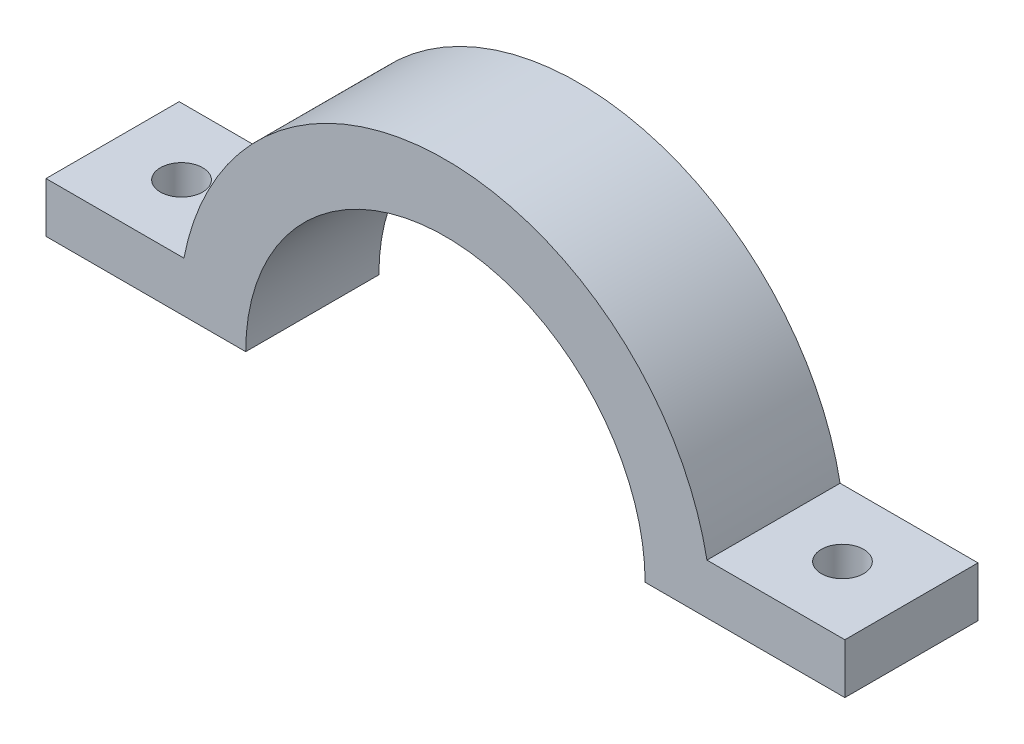
ISO-10303-21;
HEADER;
FILE_DESCRIPTION(('STEP AP214'),'2;1');
FILE_NAME('part.step','',(''),(''),'','','');
FILE_SCHEMA(('AUTOMOTIVE_DESIGN { 1 0 10303 214 1 1 1 1 }'));
ENDSEC;
DATA;
#1=APPLICATION_CONTEXT('core data for automotive mechanical design processes');
#2=APPLICATION_PROTOCOL_DEFINITION('international standard','automotive_design',2000,#1);
#3=PRODUCT_CONTEXT('',#1,'mechanical');
#4=PRODUCT('Part','Part','',(#3));
#5=PRODUCT_RELATED_PRODUCT_CATEGORY('part','',(#4));
#6=PRODUCT_DEFINITION_FORMATION('','',#4);
#7=PRODUCT_DEFINITION_CONTEXT('part definition',#1,'design');
#8=PRODUCT_DEFINITION('design','',#6,#7);
#9=PRODUCT_DEFINITION_SHAPE('','',#8);
#10=(LENGTH_UNIT() NAMED_UNIT(*) SI_UNIT(.MILLI.,.METRE.));
#11=(NAMED_UNIT(*) PLANE_ANGLE_UNIT() SI_UNIT($,.RADIAN.));
#12=(NAMED_UNIT(*) SI_UNIT($,.STERADIAN.) SOLID_ANGLE_UNIT());
#13=UNCERTAINTY_MEASURE_WITH_UNIT(LENGTH_MEASURE(1.E-05),#10,'distance_accuracy_value','');
#14=(GEOMETRIC_REPRESENTATION_CONTEXT(3) GLOBAL_UNCERTAINTY_ASSIGNED_CONTEXT((#13)) GLOBAL_UNIT_ASSIGNED_CONTEXT((#10,
#11,#12)) REPRESENTATION_CONTEXT('',''));
#15=CARTESIAN_POINT('',(0.,0.,0.));
#16=DIRECTION('',(0.,0.,1.));
#17=DIRECTION('',(1.,0.,0.));
#18=AXIS2_PLACEMENT_3D('',#15,#16,#17);
#19=CARTESIAN_POINT('',(0.,0.,10.));
#20=DIRECTION('',(0.,0.,-1.));
#21=DIRECTION('',(-1.,0.,0.));
#22=AXIS2_PLACEMENT_3D('',#19,#20,#21);
#23=CYLINDRICAL_SURFACE('',#22,15.);
#24=CARTESIAN_POINT('',(0.,0.,0.));
#25=DIRECTION('',(0.,0.,-1.));
#26=DIRECTION('',(-1.,0.,0.));
#27=AXIS2_PLACEMENT_3D('',#24,#25,#26);
#28=CIRCLE('',#27,15.);
#29=CARTESIAN_POINT('',(-15.,0.,0.));
#30=VERTEX_POINT('',#29);
#31=CARTESIAN_POINT('',(15.,0.,0.));
#32=VERTEX_POINT('',#31);
#33=EDGE_CURVE('E131',#30,#32,#28,.T.);
#34=ORIENTED_EDGE('',*,*,#33,.T.);
#35=DIRECTION('',(0.,0.,-1.));
#36=VECTOR('',#35,1.);
#37=CARTESIAN_POINT('',(15.,0.,10.));
#38=LINE('',#37,#36);
#39=CARTESIAN_POINT('',(15.,0.,10.));
#40=VERTEX_POINT('',#39);
#41=EDGE_CURVE('E11',#40,#32,#38,.T.);
#42=ORIENTED_EDGE('',*,*,#41,.F.);
#43=CARTESIAN_POINT('',(0.,0.,10.));
#44=DIRECTION('',(0.,0.,-1.));
#45=DIRECTION('',(-1.,0.,0.));
#46=AXIS2_PLACEMENT_3D('',#43,#44,#45);
#47=CIRCLE('',#46,15.);
#48=CARTESIAN_POINT('',(-15.,0.,10.));
#49=VERTEX_POINT('',#48);
#50=EDGE_CURVE('E147',#49,#40,#47,.T.);
#51=ORIENTED_EDGE('',*,*,#50,.F.);
#52=DIRECTION('',(0.,0.,-1.));
#53=VECTOR('',#52,1.);
#54=CARTESIAN_POINT('',(-15.,0.,10.));
#55=LINE('',#54,#53);
#56=EDGE_CURVE('E127',#49,#30,#55,.T.);
#57=ORIENTED_EDGE('',*,*,#56,.T.);
#58=EDGE_LOOP('',(#34,#42,#51,#57));
#59=FACE_BOUND('',#58,.T.);
#60=ADVANCED_FACE('F34',(#59),#23,.F.);
#61=CARTESIAN_POINT('',(20.,0.,10.));
#62=DIRECTION('',(0.,1.,0.));
#63=DIRECTION('',(0.,0.,1.));
#64=AXIS2_PLACEMENT_3D('',#61,#62,#63);
#65=PLANE('',#64);
#66=CARTESIAN_POINT('',(24.8211447123228,0.,5.));
#67=DIRECTION('',(0.,1.,0.));
#68=DIRECTION('',(0.,0.,1.));
#69=AXIS2_PLACEMENT_3D('',#66,#67,#68);
#70=CIRCLE('',#69,1.5875);
#71=CARTESIAN_POINT('',(24.8211447123228,0.,6.5875));
#72=VERTEX_POINT('',#71);
#73=EDGE_CURVE('E135',#72,#72,#70,.F.);
#74=ORIENTED_EDGE('',*,*,#73,.F.);
#75=EDGE_LOOP('',(#74));
#76=FACE_BOUND('',#75,.T.);
#77=DIRECTION('',(1.,0.,0.));
#78=VECTOR('',#77,1.);
#79=CARTESIAN_POINT('',(20.,0.,0.));
#80=LINE('',#79,#78);
#81=CARTESIAN_POINT('',(30.,0.,0.));
#82=VERTEX_POINT('',#81);
#83=EDGE_CURVE('E134',#32,#82,#80,.T.);
#84=ORIENTED_EDGE('',*,*,#83,.T.);
#85=DIRECTION('',(0.,0.,-1.));
#86=VECTOR('',#85,1.);
#87=CARTESIAN_POINT('',(30.,0.,10.));
#88=LINE('',#87,#86);
#89=CARTESIAN_POINT('',(30.,0.,10.));
#90=VERTEX_POINT('',#89);
#91=EDGE_CURVE('E42',#90,#82,#88,.T.);
#92=ORIENTED_EDGE('',*,*,#91,.F.);
#93=DIRECTION('',(1.,0.,0.));
#94=VECTOR('',#93,1.);
#95=CARTESIAN_POINT('',(15.,0.,10.));
#96=LINE('',#95,#94);
#97=EDGE_CURVE('E91',#40,#90,#96,.T.);
#98=ORIENTED_EDGE('',*,*,#97,.F.);
#99=ORIENTED_EDGE('',*,*,#41,.T.);
#100=EDGE_LOOP('',(#84,#92,#98,#99));
#101=FACE_BOUND('',#100,.T.);
#102=ADVANCED_FACE('F203',(#76,#101),#65,.F.);
#103=CARTESIAN_POINT('',(30.,0.,10.));
#104=DIRECTION('',(-1.,0.,0.));
#105=DIRECTION('',(0.,0.,1.));
#106=AXIS2_PLACEMENT_3D('',#103,#104,#105);
#107=PLANE('',#106);
#108=DIRECTION('',(0.,1.,0.));
#109=VECTOR('',#108,1.);
#110=CARTESIAN_POINT('',(30.,0.,0.));
#111=LINE('',#110,#109);
#112=CARTESIAN_POINT('',(30.,3.76569597265335,0.));
#113=VERTEX_POINT('',#112);
#114=EDGE_CURVE('E137',#82,#113,#111,.T.);
#115=ORIENTED_EDGE('',*,*,#114,.T.);
#116=DIRECTION('',(0.,0.,-1.));
#117=VECTOR('',#116,1.);
#118=CARTESIAN_POINT('',(30.,3.76569597265335,10.));
#119=LINE('',#118,#117);
#120=CARTESIAN_POINT('',(30.,3.76569597265335,10.));
#121=VERTEX_POINT('',#120);
#122=EDGE_CURVE('E154',#121,#113,#119,.T.);
#123=ORIENTED_EDGE('',*,*,#122,.F.);
#124=DIRECTION('',(0.,1.,0.));
#125=VECTOR('',#124,1.);
#126=CARTESIAN_POINT('',(30.,0.,10.));
#127=LINE('',#126,#125);
#128=EDGE_CURVE('E162',#90,#121,#127,.T.);
#129=ORIENTED_EDGE('',*,*,#128,.F.);
#130=ORIENTED_EDGE('',*,*,#91,.T.);
#131=EDGE_LOOP('',(#115,#123,#129,#130));
#132=FACE_BOUND('',#131,.T.);
#133=ADVANCED_FACE('F160',(#132),#107,.F.);
#134=CARTESIAN_POINT('',(30.,3.76569597265335,10.));
#135=DIRECTION('',(0.,-1.,0.));
#136=DIRECTION('',(1.,0.,0.));
#137=AXIS2_PLACEMENT_3D('',#134,#135,#136);
#138=PLANE('',#137);
#139=CARTESIAN_POINT('',(24.8211447123228,3.76569597265335,5.));
#140=DIRECTION('',(0.,1.,0.));
#141=DIRECTION('',(-1.,0.,0.));
#142=AXIS2_PLACEMENT_3D('',#139,#140,#141);
#143=CIRCLE('',#142,1.5875);
#144=CARTESIAN_POINT('',(23.2336447123228,3.76569597265335,5.));
#145=VERTEX_POINT('',#144);
#146=EDGE_CURVE('E180',#145,#145,#143,.T.);
#147=ORIENTED_EDGE('',*,*,#146,.F.);
#148=EDGE_LOOP('',(#147));
#149=FACE_BOUND('',#148,.T.);
#150=DIRECTION('',(-1.,0.,0.));
#151=VECTOR('',#150,1.);
#152=CARTESIAN_POINT('',(30.,3.76569597265335,0.));
#153=LINE('',#152,#151);
#154=CARTESIAN_POINT('',(19.6422894246455,3.76569597265336,0.));
#155=VERTEX_POINT('',#154);
#156=EDGE_CURVE('E139',#113,#155,#153,.T.);
#157=ORIENTED_EDGE('',*,*,#156,.T.);
#158=DIRECTION('',(0.,0.,-1.));
#159=VECTOR('',#158,1.);
#160=CARTESIAN_POINT('',(19.6422894246455,3.76569597265336,10.));
#161=LINE('',#160,#159);
#162=CARTESIAN_POINT('',(19.6422894246455,3.76569597265336,10.));
#163=VERTEX_POINT('',#162);
#164=EDGE_CURVE('E151',#163,#155,#161,.T.);
#165=ORIENTED_EDGE('',*,*,#164,.F.);
#166=DIRECTION('',(-1.,0.,0.));
#167=VECTOR('',#166,1.);
#168=CARTESIAN_POINT('',(30.,3.76569597265335,10.));
#169=LINE('',#168,#167);
#170=EDGE_CURVE('E172',#121,#163,#169,.T.);
#171=ORIENTED_EDGE('',*,*,#170,.F.);
#172=ORIENTED_EDGE('',*,*,#122,.T.);
#173=EDGE_LOOP('',(#157,#165,#171,#172));
#174=FACE_BOUND('',#173,.T.);
#175=ADVANCED_FACE('F168',(#149,#174),#138,.F.);
#176=CARTESIAN_POINT('',(0.,0.,10.));
#177=DIRECTION('',(0.,0.,-1.));
#178=DIRECTION('',(-1.,0.,0.));
#179=AXIS2_PLACEMENT_3D('',#176,#177,#178);
#180=CYLINDRICAL_SURFACE('',#179,20.);
#181=CARTESIAN_POINT('',(0.,0.,0.));
#182=DIRECTION('',(0.,0.,1.));
#183=DIRECTION('',(-1.,0.,0.));
#184=AXIS2_PLACEMENT_3D('',#181,#182,#183);
#185=CIRCLE('',#184,20.);
#186=CARTESIAN_POINT('',(-19.6422894246455,3.76569597265335,0.));
#187=VERTEX_POINT('',#186);
#188=EDGE_CURVE('E141',#155,#187,#185,.T.);
#189=ORIENTED_EDGE('',*,*,#188,.T.);
#190=DIRECTION('',(0.,0.,-1.));
#191=VECTOR('',#190,1.);
#192=CARTESIAN_POINT('',(-19.6422894246455,3.76569597265335,10.));
#193=LINE('',#192,#191);
#194=CARTESIAN_POINT('',(-19.6422894246455,3.76569597265335,10.));
#195=VERTEX_POINT('',#194);
#196=EDGE_CURVE('E122',#195,#187,#193,.T.);
#197=ORIENTED_EDGE('',*,*,#196,.F.);
#198=CARTESIAN_POINT('',(0.,0.,10.));
#199=DIRECTION('',(0.,0.,1.));
#200=DIRECTION('',(-1.,0.,0.));
#201=AXIS2_PLACEMENT_3D('',#198,#199,#200);
#202=CIRCLE('',#201,20.);
#203=EDGE_CURVE('E111',#163,#195,#202,.T.);
#204=ORIENTED_EDGE('',*,*,#203,.F.);
#205=ORIENTED_EDGE('',*,*,#164,.T.);
#206=EDGE_LOOP('',(#189,#197,#204,#205));
#207=FACE_BOUND('',#206,.T.);
#208=ADVANCED_FACE('F171',(#207),#180,.T.);
#209=CARTESIAN_POINT('',(-30.,3.76569597265335,10.));
#210=DIRECTION('',(0.,-1.,0.));
#211=DIRECTION('',(1.,0.,0.));
#212=AXIS2_PLACEMENT_3D('',#209,#210,#211);
#213=PLANE('',#212);
#214=CARTESIAN_POINT('',(-24.8211447123228,3.76569597265335,5.));
#215=DIRECTION('',(0.,-1.,0.));
#216=DIRECTION('',(1.,0.,0.));
#217=AXIS2_PLACEMENT_3D('',#214,#215,#216);
#218=CIRCLE('',#217,1.5875);
#219=CARTESIAN_POINT('',(-23.2336447123228,3.76569597265335,5.));
#220=VERTEX_POINT('',#219);
#221=EDGE_CURVE('E186',#220,#220,#218,.T.);
#222=ORIENTED_EDGE('',*,*,#221,.T.);
#223=EDGE_LOOP('',(#222));
#224=FACE_BOUND('',#223,.T.);
#225=DIRECTION('',(-1.,0.,0.));
#226=VECTOR('',#225,1.);
#227=CARTESIAN_POINT('',(-30.,3.76569597265335,0.));
#228=LINE('',#227,#226);
#229=CARTESIAN_POINT('',(-30.,3.76569597265335,0.));
#230=VERTEX_POINT('',#229);
#231=EDGE_CURVE('E120',#187,#230,#228,.T.);
#232=ORIENTED_EDGE('',*,*,#231,.T.);
#233=DIRECTION('',(0.,0.,-1.));
#234=VECTOR('',#233,1.);
#235=CARTESIAN_POINT('',(-30.,3.76569597265335,10.));
#236=LINE('',#235,#234);
#237=CARTESIAN_POINT('',(-30.,3.76569597265335,10.));
#238=VERTEX_POINT('',#237);
#239=EDGE_CURVE('E117',#238,#230,#236,.T.);
#240=ORIENTED_EDGE('',*,*,#239,.F.);
#241=DIRECTION('',(-1.,0.,0.));
#242=VECTOR('',#241,1.);
#243=CARTESIAN_POINT('',(-30.,3.76569597265335,10.));
#244=LINE('',#243,#242);
#245=EDGE_CURVE('E104',#195,#238,#244,.T.);
#246=ORIENTED_EDGE('',*,*,#245,.F.);
#247=ORIENTED_EDGE('',*,*,#196,.T.);
#248=EDGE_LOOP('',(#232,#240,#246,#247));
#249=FACE_BOUND('',#248,.T.);
#250=ADVANCED_FACE('F118',(#224,#249),#213,.F.);
#251=CARTESIAN_POINT('',(-30.,0.,10.));
#252=DIRECTION('',(1.,0.,0.));
#253=DIRECTION('',(0.,0.,-1.));
#254=AXIS2_PLACEMENT_3D('',#251,#252,#253);
#255=PLANE('',#254);
#256=DIRECTION('',(0.,-1.,0.));
#257=VECTOR('',#256,1.);
#258=CARTESIAN_POINT('',(-30.,0.,0.));
#259=LINE('',#258,#257);
#260=CARTESIAN_POINT('',(-30.,0.,0.));
#261=VERTEX_POINT('',#260);
#262=EDGE_CURVE('E144',#230,#261,#259,.T.);
#263=ORIENTED_EDGE('',*,*,#262,.T.);
#264=DIRECTION('',(0.,0.,-1.));
#265=VECTOR('',#264,1.);
#266=CARTESIAN_POINT('',(-30.,0.,10.));
#267=LINE('',#266,#265);
#268=CARTESIAN_POINT('',(-30.,0.,10.));
#269=VERTEX_POINT('',#268);
#270=EDGE_CURVE('E123',#269,#261,#267,.T.);
#271=ORIENTED_EDGE('',*,*,#270,.F.);
#272=DIRECTION('',(0.,-1.,0.));
#273=VECTOR('',#272,1.);
#274=CARTESIAN_POINT('',(-30.,0.,10.));
#275=LINE('',#274,#273);
#276=EDGE_CURVE('E108',#238,#269,#275,.T.);
#277=ORIENTED_EDGE('',*,*,#276,.F.);
#278=ORIENTED_EDGE('',*,*,#239,.T.);
#279=EDGE_LOOP('',(#263,#271,#277,#278));
#280=FACE_BOUND('',#279,.T.);
#281=ADVANCED_FACE('F125',(#280),#255,.F.);
#282=CARTESIAN_POINT('',(-20.,0.,10.));
#283=DIRECTION('',(0.,1.,0.));
#284=DIRECTION('',(0.,0.,1.));
#285=AXIS2_PLACEMENT_3D('',#282,#283,#284);
#286=PLANE('',#285);
#287=CARTESIAN_POINT('',(-24.8211447123228,0.,5.));
#288=DIRECTION('',(0.,1.,0.));
#289=DIRECTION('',(0.,0.,1.));
#290=AXIS2_PLACEMENT_3D('',#287,#288,#289);
#291=CIRCLE('',#290,1.5875);
#292=CARTESIAN_POINT('',(-24.8211447123228,0.,6.5875));
#293=VERTEX_POINT('',#292);
#294=EDGE_CURVE('E183',#293,#293,#291,.T.);
#295=ORIENTED_EDGE('',*,*,#294,.T.);
#296=EDGE_LOOP('',(#295));
#297=FACE_BOUND('',#296,.T.);
#298=DIRECTION('',(1.,0.,0.));
#299=VECTOR('',#298,1.);
#300=CARTESIAN_POINT('',(-20.,0.,0.));
#301=LINE('',#300,#299);
#302=EDGE_CURVE('E79',#261,#30,#301,.T.);
#303=ORIENTED_EDGE('',*,*,#302,.T.);
#304=ORIENTED_EDGE('',*,*,#56,.F.);
#305=DIRECTION('',(1.,0.,0.));
#306=VECTOR('',#305,1.);
#307=CARTESIAN_POINT('',(-20.,0.,10.));
#308=LINE('',#307,#306);
#309=EDGE_CURVE('E50',#269,#49,#308,.T.);
#310=ORIENTED_EDGE('',*,*,#309,.F.);
#311=ORIENTED_EDGE('',*,*,#270,.T.);
#312=EDGE_LOOP('',(#303,#304,#310,#311));
#313=FACE_BOUND('',#312,.T.);
#314=ADVANCED_FACE('F211',(#297,#313),#286,.F.);
#315=CARTESIAN_POINT('',(0.,0.,10.));
#316=DIRECTION('',(0.,0.,-1.));
#317=DIRECTION('',(-1.,0.,0.));
#318=AXIS2_PLACEMENT_3D('',#315,#316,#317);
#319=PLANE('',#318);
#320=ORIENTED_EDGE('',*,*,#50,.T.);
#321=ORIENTED_EDGE('',*,*,#97,.T.);
#322=ORIENTED_EDGE('',*,*,#128,.T.);
#323=ORIENTED_EDGE('',*,*,#170,.T.);
#324=ORIENTED_EDGE('',*,*,#203,.T.);
#325=ORIENTED_EDGE('',*,*,#245,.T.);
#326=ORIENTED_EDGE('',*,*,#276,.T.);
#327=ORIENTED_EDGE('',*,*,#309,.T.);
#328=EDGE_LOOP('',(#320,#321,#322,#323,#324,#325,#326,#327));
#329=FACE_BOUND('',#328,.T.);
#330=ADVANCED_FACE('F106',(#329),#319,.F.);
#331=CARTESIAN_POINT('',(0.,0.,0.));
#332=DIRECTION('',(0.,0.,-1.));
#333=DIRECTION('',(-1.,0.,0.));
#334=AXIS2_PLACEMENT_3D('',#331,#332,#333);
#335=PLANE('',#334);
#336=ORIENTED_EDGE('',*,*,#33,.F.);
#337=ORIENTED_EDGE('',*,*,#302,.F.);
#338=ORIENTED_EDGE('',*,*,#262,.F.);
#339=ORIENTED_EDGE('',*,*,#231,.F.);
#340=ORIENTED_EDGE('',*,*,#188,.F.);
#341=ORIENTED_EDGE('',*,*,#156,.F.);
#342=ORIENTED_EDGE('',*,*,#114,.F.);
#343=ORIENTED_EDGE('',*,*,#83,.F.);
#344=EDGE_LOOP('',(#336,#337,#338,#339,#340,#341,#342,#343));
#345=FACE_BOUND('',#344,.T.);
#346=ADVANCED_FACE('F164',(#345),#335,.T.);
#347=CARTESIAN_POINT('',(24.8211447123228,-4.49012806053457,5.));
#348=DIRECTION('',(0.,1.,0.));
#349=DIRECTION('',(-1.,0.,0.));
#350=AXIS2_PLACEMENT_3D('',#347,#348,#349);
#351=CYLINDRICAL_SURFACE('',#350,1.5875);
#352=ORIENTED_EDGE('',*,*,#73,.T.);
#353=EDGE_LOOP('',(#352));
#354=FACE_BOUND('',#353,.T.);
#355=ORIENTED_EDGE('',*,*,#146,.T.);
#356=EDGE_LOOP('',(#355));
#357=FACE_BOUND('',#356,.T.);
#358=ADVANCED_FACE('F193',(#354,#357),#351,.F.);
#359=CARTESIAN_POINT('',(-24.8211447123228,-4.49012806053457,5.));
#360=DIRECTION('',(0.,1.,0.));
#361=DIRECTION('',(-1.,0.,0.));
#362=AXIS2_PLACEMENT_3D('',#359,#360,#361);
#363=CYLINDRICAL_SURFACE('',#362,1.5875);
#364=ORIENTED_EDGE('',*,*,#294,.F.);
#365=EDGE_LOOP('',(#364));
#366=FACE_BOUND('',#365,.T.);
#367=ORIENTED_EDGE('',*,*,#221,.F.);
#368=EDGE_LOOP('',(#367));
#369=FACE_BOUND('',#368,.T.);
#370=ADVANCED_FACE('F191',(#366,#369),#363,.F.);
#371=CLOSED_SHELL('',(#60,#102,#133,#175,#208,#250,#281,#314,#330,#346,#358,#370));
#372=MANIFOLD_SOLID_BREP('B2',#371);
#373=ADVANCED_BREP_SHAPE_REPRESENTATION('',(#18,#372),#14);
#374=SHAPE_DEFINITION_REPRESENTATION(#9,#373);
ENDSEC;
END-ISO-10303-21;
